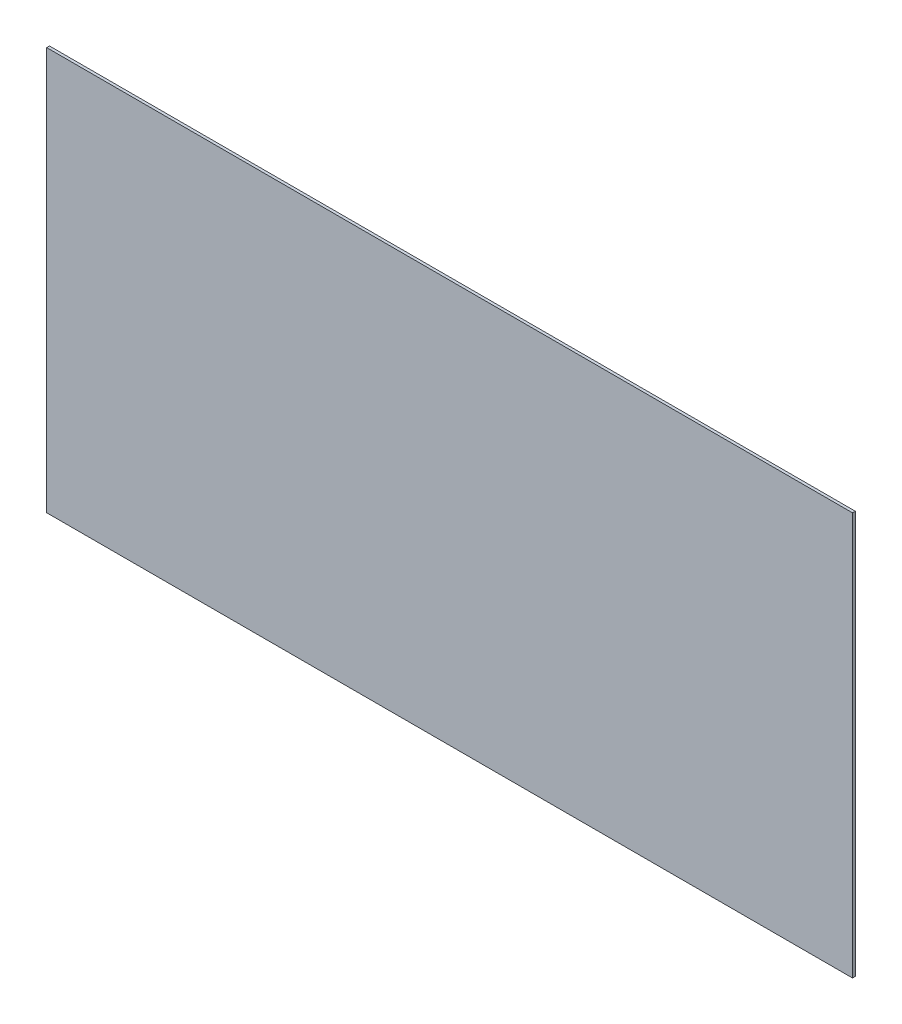
ISO-10303-21;
HEADER;
FILE_DESCRIPTION(('STEP AP214'),'2;1');
FILE_NAME('part.step','',(''),(''),'','','');
FILE_SCHEMA(('AUTOMOTIVE_DESIGN { 1 0 10303 214 1 1 1 1 }'));
ENDSEC;
DATA;
#1=APPLICATION_CONTEXT('core data for automotive mechanical design processes');
#2=APPLICATION_PROTOCOL_DEFINITION('international standard','automotive_design',2000,#1);
#3=PRODUCT_CONTEXT('',#1,'mechanical');
#4=PRODUCT('Part','Part','',(#3));
#5=PRODUCT_RELATED_PRODUCT_CATEGORY('part','',(#4));
#6=PRODUCT_DEFINITION_FORMATION('','',#4);
#7=PRODUCT_DEFINITION_CONTEXT('part definition',#1,'design');
#8=PRODUCT_DEFINITION('design','',#6,#7);
#9=PRODUCT_DEFINITION_SHAPE('','',#8);
#10=(LENGTH_UNIT() NAMED_UNIT(*) SI_UNIT(.MILLI.,.METRE.));
#11=(NAMED_UNIT(*) PLANE_ANGLE_UNIT() SI_UNIT($,.RADIAN.));
#12=(NAMED_UNIT(*) SI_UNIT($,.STERADIAN.) SOLID_ANGLE_UNIT());
#13=UNCERTAINTY_MEASURE_WITH_UNIT(LENGTH_MEASURE(1.E-05),#10,'distance_accuracy_value','');
#14=(GEOMETRIC_REPRESENTATION_CONTEXT(3) GLOBAL_UNCERTAINTY_ASSIGNED_CONTEXT((#13)) GLOBAL_UNIT_ASSIGNED_CONTEXT((#10,
#11,#12)) REPRESENTATION_CONTEXT('',''));
#15=CARTESIAN_POINT('',(0.,0.,0.));
#16=DIRECTION('',(0.,0.,1.));
#17=DIRECTION('',(1.,0.,0.));
#18=AXIS2_PLACEMENT_3D('',#15,#16,#17);
#19=CARTESIAN_POINT('',(457.2,457.2,-3.175));
#20=DIRECTION('',(1.,0.,0.));
#21=DIRECTION('',(0.,0.,-1.));
#22=AXIS2_PLACEMENT_3D('',#19,#20,#21);
#23=PLANE('',#22);
#24=DIRECTION('',(0.,1.,0.));
#25=VECTOR('',#24,1.);
#26=CARTESIAN_POINT('',(457.2,457.2,0.));
#27=LINE('',#26,#25);
#28=CARTESIAN_POINT('',(457.2,1.67972554971051E-13,0.));
#29=VERTEX_POINT('',#28);
#30=CARTESIAN_POINT('',(457.2,457.2,0.));
#31=VERTEX_POINT('',#30);
#32=EDGE_CURVE('E113',#29,#31,#27,.T.);
#33=ORIENTED_EDGE('',*,*,#32,.F.);
#34=DIRECTION('',(0.,0.,1.));
#35=VECTOR('',#34,1.);
#36=CARTESIAN_POINT('',(457.2,1.67972554971051E-13,-3.175));
#37=LINE('',#36,#35);
#38=CARTESIAN_POINT('',(457.2,1.67972554971051E-13,-3.175));
#39=VERTEX_POINT('',#38);
#40=EDGE_CURVE('E11',#39,#29,#37,.T.);
#41=ORIENTED_EDGE('',*,*,#40,.F.);
#42=DIRECTION('',(0.,1.,0.));
#43=VECTOR('',#42,1.);
#44=CARTESIAN_POINT('',(457.2,457.2,-3.175));
#45=LINE('',#44,#43);
#46=CARTESIAN_POINT('',(457.2,457.2,-3.175));
#47=VERTEX_POINT('',#46);
#48=EDGE_CURVE('E105',#39,#47,#45,.T.);
#49=ORIENTED_EDGE('',*,*,#48,.T.);
#50=DIRECTION('',(0.,0.,1.));
#51=VECTOR('',#50,1.);
#52=CARTESIAN_POINT('',(457.2,457.2,-3.175));
#53=LINE('',#52,#51);
#54=EDGE_CURVE('E46',#47,#31,#53,.T.);
#55=ORIENTED_EDGE('',*,*,#54,.T.);
#56=EDGE_LOOP('',(#33,#41,#49,#55));
#57=FACE_BOUND('',#56,.T.);
#58=ADVANCED_FACE('F43',(#57),#23,.T.);
#59=CARTESIAN_POINT('',(-457.2,0.,-3.175));
#60=DIRECTION('',(0.,-1.,0.));
#61=DIRECTION('',(1.,0.,0.));
#62=AXIS2_PLACEMENT_3D('',#59,#60,#61);
#63=PLANE('',#62);
#64=DIRECTION('',(1.,0.,0.));
#65=VECTOR('',#64,1.);
#66=CARTESIAN_POINT('',(-457.2,0.,0.));
#67=LINE('',#66,#65);
#68=CARTESIAN_POINT('',(-457.2,0.,0.));
#69=VERTEX_POINT('',#68);
#70=EDGE_CURVE('E108',#69,#29,#67,.T.);
#71=ORIENTED_EDGE('',*,*,#70,.F.);
#72=DIRECTION('',(0.,0.,1.));
#73=VECTOR('',#72,1.);
#74=CARTESIAN_POINT('',(-457.2,0.,-3.175));
#75=LINE('',#74,#73);
#76=CARTESIAN_POINT('',(-457.2,0.,-3.175));
#77=VERTEX_POINT('',#76);
#78=EDGE_CURVE('E53',#77,#69,#75,.T.);
#79=ORIENTED_EDGE('',*,*,#78,.F.);
#80=DIRECTION('',(1.,0.,0.));
#81=VECTOR('',#80,1.);
#82=CARTESIAN_POINT('',(-457.2,0.,-3.175));
#83=LINE('',#82,#81);
#84=EDGE_CURVE('E100',#77,#39,#83,.T.);
#85=ORIENTED_EDGE('',*,*,#84,.T.);
#86=ORIENTED_EDGE('',*,*,#40,.T.);
#87=EDGE_LOOP('',(#71,#79,#85,#86));
#88=FACE_BOUND('',#87,.T.);
#89=ADVANCED_FACE('F129',(#88),#63,.T.);
#90=CARTESIAN_POINT('',(-457.2,0.,-3.175));
#91=DIRECTION('',(-1.,0.,0.));
#92=DIRECTION('',(0.,0.,1.));
#93=AXIS2_PLACEMENT_3D('',#90,#91,#92);
#94=PLANE('',#93);
#95=DIRECTION('',(0.,-1.,0.));
#96=VECTOR('',#95,1.);
#97=CARTESIAN_POINT('',(-457.2,0.,0.));
#98=LINE('',#97,#96);
#99=CARTESIAN_POINT('',(-457.2,457.2,0.));
#100=VERTEX_POINT('',#99);
#101=EDGE_CURVE('E94',#100,#69,#98,.T.);
#102=ORIENTED_EDGE('',*,*,#101,.F.);
#103=DIRECTION('',(0.,0.,1.));
#104=VECTOR('',#103,1.);
#105=CARTESIAN_POINT('',(-457.2,457.2,-3.175));
#106=LINE('',#105,#104);
#107=CARTESIAN_POINT('',(-457.2,457.2,-3.175));
#108=VERTEX_POINT('',#107);
#109=EDGE_CURVE('E89',#108,#100,#106,.T.);
#110=ORIENTED_EDGE('',*,*,#109,.F.);
#111=DIRECTION('',(0.,-1.,0.));
#112=VECTOR('',#111,1.);
#113=CARTESIAN_POINT('',(-457.2,0.,-3.175));
#114=LINE('',#113,#112);
#115=EDGE_CURVE('E92',#108,#77,#114,.T.);
#116=ORIENTED_EDGE('',*,*,#115,.T.);
#117=ORIENTED_EDGE('',*,*,#78,.T.);
#118=EDGE_LOOP('',(#102,#110,#116,#117));
#119=FACE_BOUND('',#118,.T.);
#120=ADVANCED_FACE('F91',(#119),#94,.T.);
#121=CARTESIAN_POINT('',(-457.2,457.2,-3.175));
#122=DIRECTION('',(0.,1.,0.));
#123=DIRECTION('',(0.,0.,1.));
#124=AXIS2_PLACEMENT_3D('',#121,#122,#123);
#125=PLANE('',#124);
#126=DIRECTION('',(-1.,0.,0.));
#127=VECTOR('',#126,1.);
#128=CARTESIAN_POINT('',(-457.2,457.2,0.));
#129=LINE('',#128,#127);
#130=EDGE_CURVE('E117',#31,#100,#129,.T.);
#131=ORIENTED_EDGE('',*,*,#130,.F.);
#132=ORIENTED_EDGE('',*,*,#54,.F.);
#133=DIRECTION('',(-1.,0.,0.));
#134=VECTOR('',#133,1.);
#135=CARTESIAN_POINT('',(-457.2,457.2,-3.175));
#136=LINE('',#135,#134);
#137=EDGE_CURVE('E99',#47,#108,#136,.T.);
#138=ORIENTED_EDGE('',*,*,#137,.T.);
#139=ORIENTED_EDGE('',*,*,#109,.T.);
#140=EDGE_LOOP('',(#131,#132,#138,#139));
#141=FACE_BOUND('',#140,.T.);
#142=ADVANCED_FACE('F103',(#141),#125,.T.);
#143=CARTESIAN_POINT('',(0.,0.,-3.175));
#144=DIRECTION('',(0.,0.,1.));
#145=DIRECTION('',(1.,0.,0.));
#146=AXIS2_PLACEMENT_3D('',#143,#144,#145);
#147=PLANE('',#146);
#148=ORIENTED_EDGE('',*,*,#48,.F.);
#149=ORIENTED_EDGE('',*,*,#84,.F.);
#150=ORIENTED_EDGE('',*,*,#115,.F.);
#151=ORIENTED_EDGE('',*,*,#137,.F.);
#152=EDGE_LOOP('',(#148,#149,#150,#151));
#153=FACE_BOUND('',#152,.T.);
#154=ADVANCED_FACE('F98',(#153),#147,.F.);
#155=CARTESIAN_POINT('',(0.,0.,0.));
#156=DIRECTION('',(0.,0.,1.));
#157=DIRECTION('',(1.,0.,0.));
#158=AXIS2_PLACEMENT_3D('',#155,#156,#157);
#159=PLANE('',#158);
#160=ORIENTED_EDGE('',*,*,#32,.T.);
#161=ORIENTED_EDGE('',*,*,#130,.T.);
#162=ORIENTED_EDGE('',*,*,#101,.T.);
#163=ORIENTED_EDGE('',*,*,#70,.T.);
#164=EDGE_LOOP('',(#160,#161,#162,#163));
#165=FACE_BOUND('',#164,.T.);
#166=ADVANCED_FACE('F128',(#165),#159,.T.);
#167=CLOSED_SHELL('',(#58,#89,#120,#142,#154,#166));
#168=MANIFOLD_SOLID_BREP('B2',#167);
#169=ADVANCED_BREP_SHAPE_REPRESENTATION('',(#18,#168),#14);
#170=SHAPE_DEFINITION_REPRESENTATION(#9,#169);
ENDSEC;
END-ISO-10303-21;
